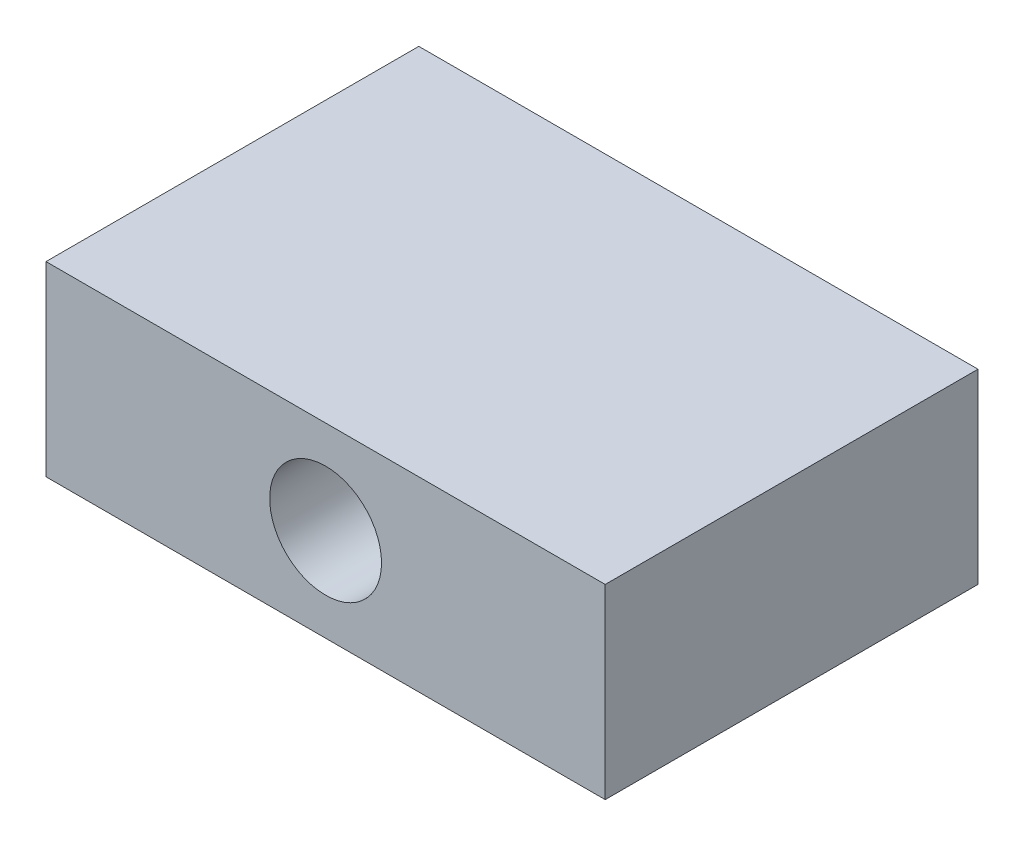
ISO-10303-21;
HEADER;
FILE_DESCRIPTION(('STEP AP214'),'2;1');
FILE_NAME('part.step','',(''),(''),'','','');
FILE_SCHEMA(('AUTOMOTIVE_DESIGN { 1 0 10303 214 1 1 1 1 }'));
ENDSEC;
DATA;
#1=APPLICATION_CONTEXT('core data for automotive mechanical design processes');
#2=APPLICATION_PROTOCOL_DEFINITION('international standard','automotive_design',2000,#1);
#3=PRODUCT_CONTEXT('',#1,'mechanical');
#4=PRODUCT('Part','Part','',(#3));
#5=PRODUCT_RELATED_PRODUCT_CATEGORY('part','',(#4));
#6=PRODUCT_DEFINITION_FORMATION('','',#4);
#7=PRODUCT_DEFINITION_CONTEXT('part definition',#1,'design');
#8=PRODUCT_DEFINITION('design','',#6,#7);
#9=PRODUCT_DEFINITION_SHAPE('','',#8);
#10=(LENGTH_UNIT() NAMED_UNIT(*) SI_UNIT(.MILLI.,.METRE.));
#11=(NAMED_UNIT(*) PLANE_ANGLE_UNIT() SI_UNIT($,.RADIAN.));
#12=(NAMED_UNIT(*) SI_UNIT($,.STERADIAN.) SOLID_ANGLE_UNIT());
#13=UNCERTAINTY_MEASURE_WITH_UNIT(LENGTH_MEASURE(1.E-05),#10,'distance_accuracy_value','');
#14=(GEOMETRIC_REPRESENTATION_CONTEXT(3) GLOBAL_UNCERTAINTY_ASSIGNED_CONTEXT((#13)) GLOBAL_UNIT_ASSIGNED_CONTEXT((#10,
#11,#12)) REPRESENTATION_CONTEXT('',''));
#15=CARTESIAN_POINT('',(0.,0.,0.));
#16=DIRECTION('',(0.,0.,1.));
#17=DIRECTION('',(1.,0.,0.));
#18=AXIS2_PLACEMENT_3D('',#15,#16,#17);
#19=CARTESIAN_POINT('',(30.,0.,0.));
#20=DIRECTION('',(0.,0.,-1.));
#21=DIRECTION('',(-1.,0.,0.));
#22=AXIS2_PLACEMENT_3D('',#19,#20,#21);
#23=PLANE('',#22);
#24=CARTESIAN_POINT('',(15.,5.,0.));
#25=DIRECTION('',(0.,0.,1.));
#26=DIRECTION('',(1.,0.,0.));
#27=AXIS2_PLACEMENT_3D('',#24,#25,#26);
#28=CIRCLE('',#27,3.);
#29=CARTESIAN_POINT('',(18.,5.,0.));
#30=VERTEX_POINT('',#29);
#31=EDGE_CURVE('E108',#30,#30,#28,.T.);
#32=ORIENTED_EDGE('',*,*,#31,.F.);
#33=EDGE_LOOP('',(#32));
#34=FACE_BOUND('',#33,.T.);
#35=DIRECTION('',(0.,-1.,0.));
#36=VECTOR('',#35,1.);
#37=CARTESIAN_POINT('',(0.,0.,0.));
#38=LINE('',#37,#36);
#39=CARTESIAN_POINT('',(0.,10.,0.));
#40=VERTEX_POINT('',#39);
#41=CARTESIAN_POINT('',(0.,0.,0.));
#42=VERTEX_POINT('',#41);
#43=EDGE_CURVE('E94',#40,#42,#38,.T.);
#44=ORIENTED_EDGE('',*,*,#43,.T.);
#45=DIRECTION('',(-1.,0.,0.));
#46=VECTOR('',#45,1.);
#47=CARTESIAN_POINT('',(30.,0.,0.));
#48=LINE('',#47,#46);
#49=CARTESIAN_POINT('',(30.,0.,0.));
#50=VERTEX_POINT('',#49);
#51=EDGE_CURVE('E11',#50,#42,#48,.T.);
#52=ORIENTED_EDGE('',*,*,#51,.F.);
#53=DIRECTION('',(0.,-1.,0.));
#54=VECTOR('',#53,1.);
#55=CARTESIAN_POINT('',(30.,0.,0.));
#56=LINE('',#55,#54);
#57=CARTESIAN_POINT('',(30.,10.,0.));
#58=VERTEX_POINT('',#57);
#59=EDGE_CURVE('E82',#58,#50,#56,.T.);
#60=ORIENTED_EDGE('',*,*,#59,.F.);
#61=DIRECTION('',(-1.,0.,0.));
#62=VECTOR('',#61,1.);
#63=CARTESIAN_POINT('',(30.,10.,0.));
#64=LINE('',#63,#62);
#65=EDGE_CURVE('E90',#58,#40,#64,.T.);
#66=ORIENTED_EDGE('',*,*,#65,.T.);
#67=EDGE_LOOP('',(#44,#52,#60,#66));
#68=FACE_BOUND('',#67,.T.);
#69=ADVANCED_FACE('F31',(#34,#68),#23,.F.);
#70=CARTESIAN_POINT('',(30.,0.,0.));
#71=DIRECTION('',(0.,1.,0.));
#72=DIRECTION('',(0.,0.,1.));
#73=AXIS2_PLACEMENT_3D('',#70,#71,#72);
#74=PLANE('',#73);
#75=DIRECTION('',(0.,0.,-1.));
#76=VECTOR('',#75,1.);
#77=CARTESIAN_POINT('',(0.,0.,0.));
#78=LINE('',#77,#76);
#79=CARTESIAN_POINT('',(0.,0.,-20.));
#80=VERTEX_POINT('',#79);
#81=EDGE_CURVE('E86',#42,#80,#78,.T.);
#82=ORIENTED_EDGE('',*,*,#81,.T.);
#83=DIRECTION('',(-1.,0.,0.));
#84=VECTOR('',#83,1.);
#85=CARTESIAN_POINT('',(30.,0.,-20.));
#86=LINE('',#85,#84);
#87=CARTESIAN_POINT('',(30.,0.,-20.));
#88=VERTEX_POINT('',#87);
#89=EDGE_CURVE('E39',#88,#80,#86,.T.);
#90=ORIENTED_EDGE('',*,*,#89,.F.);
#91=DIRECTION('',(0.,0.,-1.));
#92=VECTOR('',#91,1.);
#93=CARTESIAN_POINT('',(30.,0.,0.));
#94=LINE('',#93,#92);
#95=EDGE_CURVE('E77',#50,#88,#94,.T.);
#96=ORIENTED_EDGE('',*,*,#95,.F.);
#97=ORIENTED_EDGE('',*,*,#51,.T.);
#98=EDGE_LOOP('',(#82,#90,#96,#97));
#99=FACE_BOUND('',#98,.T.);
#100=ADVANCED_FACE('F85',(#99),#74,.F.);
#101=CARTESIAN_POINT('',(30.,0.,-20.));
#102=DIRECTION('',(0.,0.,1.));
#103=DIRECTION('',(1.,0.,0.));
#104=AXIS2_PLACEMENT_3D('',#101,#102,#103);
#105=PLANE('',#104);
#106=CARTESIAN_POINT('',(15.,5.,-20.));
#107=DIRECTION('',(0.,0.,1.));
#108=DIRECTION('',(1.,0.,0.));
#109=AXIS2_PLACEMENT_3D('',#106,#107,#108);
#110=CIRCLE('',#109,3.);
#111=CARTESIAN_POINT('',(18.,5.,-20.));
#112=VERTEX_POINT('',#111);
#113=EDGE_CURVE('E97',#112,#112,#110,.T.);
#114=ORIENTED_EDGE('',*,*,#113,.T.);
#115=EDGE_LOOP('',(#114));
#116=FACE_BOUND('',#115,.T.);
#117=DIRECTION('',(0.,1.,0.));
#118=VECTOR('',#117,1.);
#119=CARTESIAN_POINT('',(0.,0.,-20.));
#120=LINE('',#119,#118);
#121=CARTESIAN_POINT('',(0.,10.,-20.));
#122=VERTEX_POINT('',#121);
#123=EDGE_CURVE('E64',#80,#122,#120,.T.);
#124=ORIENTED_EDGE('',*,*,#123,.T.);
#125=DIRECTION('',(-1.,0.,0.));
#126=VECTOR('',#125,1.);
#127=CARTESIAN_POINT('',(30.,10.,-20.));
#128=LINE('',#127,#126);
#129=CARTESIAN_POINT('',(30.,10.,-20.));
#130=VERTEX_POINT('',#129);
#131=EDGE_CURVE('E87',#130,#122,#128,.T.);
#132=ORIENTED_EDGE('',*,*,#131,.F.);
#133=DIRECTION('',(0.,1.,0.));
#134=VECTOR('',#133,1.);
#135=CARTESIAN_POINT('',(30.,0.,-20.));
#136=LINE('',#135,#134);
#137=EDGE_CURVE('E80',#88,#130,#136,.T.);
#138=ORIENTED_EDGE('',*,*,#137,.F.);
#139=ORIENTED_EDGE('',*,*,#89,.T.);
#140=EDGE_LOOP('',(#124,#132,#138,#139));
#141=FACE_BOUND('',#140,.T.);
#142=ADVANCED_FACE('F88',(#116,#141),#105,.F.);
#143=CARTESIAN_POINT('',(30.,10.,0.));
#144=DIRECTION('',(0.,-1.,0.));
#145=DIRECTION('',(0.,0.,-1.));
#146=AXIS2_PLACEMENT_3D('',#143,#144,#145);
#147=PLANE('',#146);
#148=DIRECTION('',(0.,0.,1.));
#149=VECTOR('',#148,1.);
#150=CARTESIAN_POINT('',(0.,10.,0.));
#151=LINE('',#150,#149);
#152=EDGE_CURVE('E70',#122,#40,#151,.T.);
#153=ORIENTED_EDGE('',*,*,#152,.T.);
#154=ORIENTED_EDGE('',*,*,#65,.F.);
#155=DIRECTION('',(0.,0.,1.));
#156=VECTOR('',#155,1.);
#157=CARTESIAN_POINT('',(30.,10.,0.));
#158=LINE('',#157,#156);
#159=EDGE_CURVE('E47',#130,#58,#158,.T.);
#160=ORIENTED_EDGE('',*,*,#159,.F.);
#161=ORIENTED_EDGE('',*,*,#131,.T.);
#162=EDGE_LOOP('',(#153,#154,#160,#161));
#163=FACE_BOUND('',#162,.T.);
#164=ADVANCED_FACE('F102',(#163),#147,.F.);
#165=CARTESIAN_POINT('',(30.,10.,0.));
#166=DIRECTION('',(-1.,0.,0.));
#167=DIRECTION('',(0.,0.,1.));
#168=AXIS2_PLACEMENT_3D('',#165,#166,#167);
#169=PLANE('',#168);
#170=ORIENTED_EDGE('',*,*,#59,.T.);
#171=ORIENTED_EDGE('',*,*,#95,.T.);
#172=ORIENTED_EDGE('',*,*,#137,.T.);
#173=ORIENTED_EDGE('',*,*,#159,.T.);
#174=EDGE_LOOP('',(#170,#171,#172,#173));
#175=FACE_BOUND('',#174,.T.);
#176=ADVANCED_FACE('F78',(#175),#169,.F.);
#177=CARTESIAN_POINT('',(0.,10.,0.));
#178=DIRECTION('',(-1.,0.,0.));
#179=DIRECTION('',(0.,0.,1.));
#180=AXIS2_PLACEMENT_3D('',#177,#178,#179);
#181=PLANE('',#180);
#182=ORIENTED_EDGE('',*,*,#43,.F.);
#183=ORIENTED_EDGE('',*,*,#152,.F.);
#184=ORIENTED_EDGE('',*,*,#123,.F.);
#185=ORIENTED_EDGE('',*,*,#81,.F.);
#186=EDGE_LOOP('',(#182,#183,#184,#185));
#187=FACE_BOUND('',#186,.T.);
#188=ADVANCED_FACE('F105',(#187),#181,.T.);
#189=CARTESIAN_POINT('',(15.,5.,-20.));
#190=DIRECTION('',(0.,0.,1.));
#191=DIRECTION('',(1.,0.,0.));
#192=AXIS2_PLACEMENT_3D('',#189,#190,#191);
#193=CYLINDRICAL_SURFACE('',#192,3.);
#194=ORIENTED_EDGE('',*,*,#113,.F.);
#195=EDGE_LOOP('',(#194));
#196=FACE_BOUND('',#195,.T.);
#197=ORIENTED_EDGE('',*,*,#31,.T.);
#198=EDGE_LOOP('',(#197));
#199=FACE_BOUND('',#198,.T.);
#200=ADVANCED_FACE('F115',(#196,#199),#193,.F.);
#201=CLOSED_SHELL('',(#69,#100,#142,#164,#176,#188,#200));
#202=MANIFOLD_SOLID_BREP('B2',#201);
#203=ADVANCED_BREP_SHAPE_REPRESENTATION('',(#18,#202),#14);
#204=SHAPE_DEFINITION_REPRESENTATION(#9,#203);
ENDSEC;
END-ISO-10303-21;
